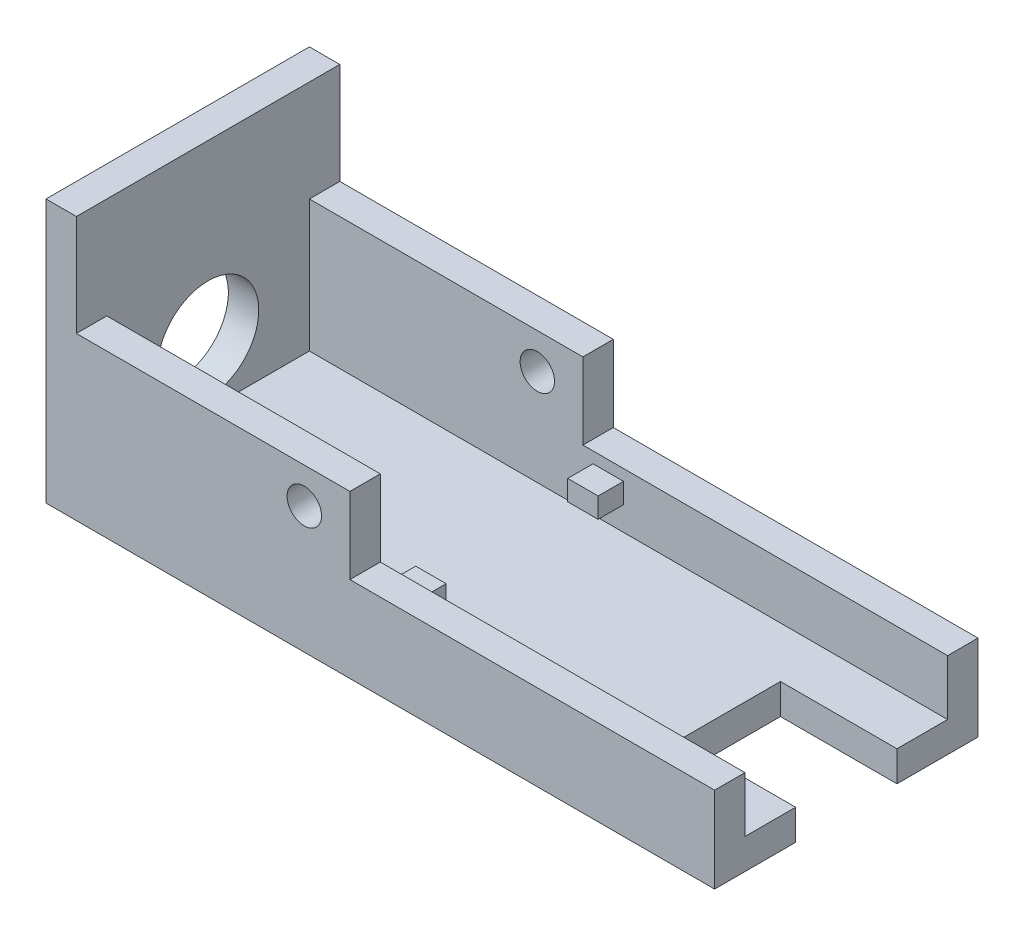
ISO-10303-21;
HEADER;
FILE_DESCRIPTION(('STEP AP214'),'2;1');
FILE_NAME('part.step','',(''),(''),'','','');
FILE_SCHEMA(('AUTOMOTIVE_DESIGN { 1 0 10303 214 1 1 1 1 }'));
ENDSEC;
DATA;
#1=APPLICATION_CONTEXT('core data for automotive mechanical design processes');
#2=APPLICATION_PROTOCOL_DEFINITION('international standard','automotive_design',2000,#1);
#3=PRODUCT_CONTEXT('',#1,'mechanical');
#4=PRODUCT('Part','Part','',(#3));
#5=PRODUCT_RELATED_PRODUCT_CATEGORY('part','',(#4));
#6=PRODUCT_DEFINITION_FORMATION('','',#4);
#7=PRODUCT_DEFINITION_CONTEXT('part definition',#1,'design');
#8=PRODUCT_DEFINITION('design','',#6,#7);
#9=PRODUCT_DEFINITION_SHAPE('','',#8);
#10=(LENGTH_UNIT() NAMED_UNIT(*) SI_UNIT(.MILLI.,.METRE.));
#11=(NAMED_UNIT(*) PLANE_ANGLE_UNIT() SI_UNIT($,.RADIAN.));
#12=(NAMED_UNIT(*) SI_UNIT($,.STERADIAN.) SOLID_ANGLE_UNIT());
#13=UNCERTAINTY_MEASURE_WITH_UNIT(LENGTH_MEASURE(1.E-05),#10,'distance_accuracy_value','');
#14=(GEOMETRIC_REPRESENTATION_CONTEXT(3) GLOBAL_UNCERTAINTY_ASSIGNED_CONTEXT((#13)) GLOBAL_UNIT_ASSIGNED_CONTEXT((#10,
#11,#12)) REPRESENTATION_CONTEXT('',''));
#15=CARTESIAN_POINT('',(0.,0.,0.));
#16=DIRECTION('',(0.,0.,1.));
#17=DIRECTION('',(1.,0.,0.));
#18=AXIS2_PLACEMENT_3D('',#15,#16,#17);
#19=CARTESIAN_POINT('',(-33.,3.,-13.));
#20=DIRECTION('',(0.,0.,-1.));
#21=DIRECTION('',(-1.,0.,0.));
#22=AXIS2_PLACEMENT_3D('',#19,#20,#21);
#23=PLANE('',#22);
#24=DIRECTION('',(1.,0.,0.));
#25=VECTOR('',#24,1.);
#26=CARTESIAN_POINT('',(-33.,0.,-13.));
#27=LINE('',#26,#25);
#28=CARTESIAN_POINT('',(-33.,0.,-13.));
#29=VERTEX_POINT('',#28);
#30=CARTESIAN_POINT('',(33.,0.,-13.));
#31=VERTEX_POINT('',#30);
#32=EDGE_CURVE('E396',#29,#31,#27,.T.);
#33=ORIENTED_EDGE('',*,*,#32,.F.);
#34=DIRECTION('',(0.,-1.,0.));
#35=VECTOR('',#34,1.);
#36=CARTESIAN_POINT('',(-33.,3.,-13.));
#37=LINE('',#36,#35);
#38=CARTESIAN_POINT('',(-33.,26.,-13.));
#39=VERTEX_POINT('',#38);
#40=EDGE_CURVE('E403',#39,#29,#37,.T.);
#41=ORIENTED_EDGE('',*,*,#40,.F.);
#42=DIRECTION('',(1.,0.,0.));
#43=VECTOR('',#42,1.);
#44=CARTESIAN_POINT('',(0.,26.,-13.));
#45=LINE('',#44,#43);
#46=CARTESIAN_POINT('',(-30.,26.,-13.));
#47=VERTEX_POINT('',#46);
#48=EDGE_CURVE('E328',#39,#47,#45,.T.);
#49=ORIENTED_EDGE('',*,*,#48,.T.);
#50=DIRECTION('',(0.,-1.,0.));
#51=VECTOR('',#50,1.);
#52=CARTESIAN_POINT('',(-30.,26.,-13.));
#53=LINE('',#52,#51);
#54=CARTESIAN_POINT('',(-30.,16.,-13.));
#55=VERTEX_POINT('',#54);
#56=EDGE_CURVE('E333',#47,#55,#53,.T.);
#57=ORIENTED_EDGE('',*,*,#56,.T.);
#58=DIRECTION('',(-1.,0.,0.));
#59=VECTOR('',#58,1.);
#60=CARTESIAN_POINT('',(0.,16.,-13.));
#61=LINE('',#60,#59);
#62=CARTESIAN_POINT('',(-3.,16.,-13.));
#63=VERTEX_POINT('',#62);
#64=EDGE_CURVE('E347',#63,#55,#61,.T.);
#65=ORIENTED_EDGE('',*,*,#64,.F.);
#66=DIRECTION('',(0.,-1.,0.));
#67=VECTOR('',#66,1.);
#68=CARTESIAN_POINT('',(-3.,16.,-13.));
#69=LINE('',#68,#67);
#70=CARTESIAN_POINT('',(-3.,8.46,-13.));
#71=VERTEX_POINT('',#70);
#72=EDGE_CURVE('E362',#63,#71,#69,.T.);
#73=ORIENTED_EDGE('',*,*,#72,.T.);
#74=DIRECTION('',(-1.,0.,0.));
#75=VECTOR('',#74,1.);
#76=CARTESIAN_POINT('',(0.,8.46,-13.));
#77=LINE('',#76,#75);
#78=CARTESIAN_POINT('',(33.,8.46,-13.));
#79=VERTEX_POINT('',#78);
#80=EDGE_CURVE('E309',#79,#71,#77,.T.);
#81=ORIENTED_EDGE('',*,*,#80,.F.);
#82=DIRECTION('',(0.,-1.,0.));
#83=VECTOR('',#82,1.);
#84=CARTESIAN_POINT('',(33.,3.,-13.));
#85=LINE('',#84,#83);
#86=EDGE_CURVE('E405',#79,#31,#85,.T.);
#87=ORIENTED_EDGE('',*,*,#86,.T.);
#88=EDGE_LOOP('',(#33,#41,#49,#57,#65,#73,#81,#87));
#89=FACE_BOUND('',#88,.T.);
#90=CARTESIAN_POINT('',(-7.5,12.5,-13.));
#91=DIRECTION('',(0.,0.,1.));
#92=DIRECTION('',(1.,0.,0.));
#93=AXIS2_PLACEMENT_3D('',#90,#91,#92);
#94=CIRCLE('',#93,1.7);
#95=CARTESIAN_POINT('',(-5.8,12.5,-13.));
#96=VERTEX_POINT('',#95);
#97=EDGE_CURVE('E424',#96,#96,#94,.T.);
#98=ORIENTED_EDGE('',*,*,#97,.T.);
#99=EDGE_LOOP('',(#98));
#100=FACE_BOUND('',#99,.T.);
#101=ADVANCED_FACE('F37',(#89,#100),#23,.T.);
#102=CARTESIAN_POINT('',(33.,3.,13.));
#103=DIRECTION('',(-1.,0.,0.));
#104=DIRECTION('',(0.,0.,1.));
#105=AXIS2_PLACEMENT_3D('',#102,#103,#104);
#106=PLANE('',#105);
#107=DIRECTION('',(0.,0.,-1.));
#108=VECTOR('',#107,1.);
#109=CARTESIAN_POINT('',(33.,3.,13.));
#110=LINE('',#109,#108);
#111=CARTESIAN_POINT('',(33.,3.,-5.));
#112=VERTEX_POINT('',#111);
#113=CARTESIAN_POINT('',(33.,3.,-10.));
#114=VERTEX_POINT('',#113);
#115=EDGE_CURVE('E389',#112,#114,#110,.T.);
#116=ORIENTED_EDGE('',*,*,#115,.F.);
#117=DIRECTION('',(0.,-1.,0.));
#118=VECTOR('',#117,1.);
#119=CARTESIAN_POINT('',(33.,26.,-5.));
#120=LINE('',#119,#118);
#121=CARTESIAN_POINT('',(33.,0.,-5.));
#122=VERTEX_POINT('',#121);
#123=EDGE_CURVE('E231',#112,#122,#120,.T.);
#124=ORIENTED_EDGE('',*,*,#123,.T.);
#125=DIRECTION('',(0.,0.,-1.));
#126=VECTOR('',#125,1.);
#127=CARTESIAN_POINT('',(33.,0.,13.));
#128=LINE('',#127,#126);
#129=EDGE_CURVE('E392',#122,#31,#128,.T.);
#130=ORIENTED_EDGE('',*,*,#129,.T.);
#131=ORIENTED_EDGE('',*,*,#86,.F.);
#132=DIRECTION('',(0.,0.,-1.));
#133=VECTOR('',#132,1.);
#134=CARTESIAN_POINT('',(33.,8.46,0.));
#135=LINE('',#134,#133);
#136=CARTESIAN_POINT('',(33.,8.46,-10.));
#137=VERTEX_POINT('',#136);
#138=EDGE_CURVE('E318',#137,#79,#135,.T.);
#139=ORIENTED_EDGE('',*,*,#138,.F.);
#140=DIRECTION('',(0.,-1.,0.));
#141=VECTOR('',#140,1.);
#142=CARTESIAN_POINT('',(33.,6.,-10.));
#143=LINE('',#142,#141);
#144=EDGE_CURVE('E374',#137,#114,#143,.T.);
#145=ORIENTED_EDGE('',*,*,#144,.T.);
#146=EDGE_LOOP('',(#116,#124,#130,#131,#139,#145));
#147=FACE_BOUND('',#146,.T.);
#148=ADVANCED_FACE('F464',(#147),#106,.F.);
#149=CARTESIAN_POINT('',(0.,6.,-10.));
#150=DIRECTION('',(0.,0.,1.));
#151=DIRECTION('',(1.,0.,0.));
#152=AXIS2_PLACEMENT_3D('',#149,#150,#151);
#153=PLANE('',#152);
#154=CARTESIAN_POINT('',(-7.5,12.5,-10.));
#155=DIRECTION('',(0.,0.,1.));
#156=DIRECTION('',(1.,0.,0.));
#157=AXIS2_PLACEMENT_3D('',#154,#155,#156);
#158=CIRCLE('',#157,1.7);
#159=CARTESIAN_POINT('',(-5.8,12.5,-10.));
#160=VERTEX_POINT('',#159);
#161=EDGE_CURVE('E418',#160,#160,#158,.T.);
#162=ORIENTED_EDGE('',*,*,#161,.F.);
#163=EDGE_LOOP('',(#162));
#164=FACE_BOUND('',#163,.T.);
#165=DIRECTION('',(-1.,0.,0.));
#166=VECTOR('',#165,1.);
#167=CARTESIAN_POINT('',(0.,3.,-10.));
#168=LINE('',#167,#166);
#169=CARTESIAN_POINT('',(-30.,3.,-10.));
#170=VERTEX_POINT('',#169);
#171=EDGE_CURVE('E367',#114,#170,#168,.T.);
#172=ORIENTED_EDGE('',*,*,#171,.F.);
#173=ORIENTED_EDGE('',*,*,#144,.F.);
#174=DIRECTION('',(1.,0.,0.));
#175=VECTOR('',#174,1.);
#176=CARTESIAN_POINT('',(0.,8.46,-10.));
#177=LINE('',#176,#175);
#178=CARTESIAN_POINT('',(-3.,8.46,-10.));
#179=VERTEX_POINT('',#178);
#180=EDGE_CURVE('E315',#179,#137,#177,.T.);
#181=ORIENTED_EDGE('',*,*,#180,.F.);
#182=DIRECTION('',(0.,-1.,0.));
#183=VECTOR('',#182,1.);
#184=CARTESIAN_POINT('',(-3.,16.,-10.));
#185=LINE('',#184,#183);
#186=CARTESIAN_POINT('',(-3.,16.,-10.));
#187=VERTEX_POINT('',#186);
#188=EDGE_CURVE('E365',#187,#179,#185,.T.);
#189=ORIENTED_EDGE('',*,*,#188,.F.);
#190=DIRECTION('',(1.,0.,0.));
#191=VECTOR('',#190,1.);
#192=CARTESIAN_POINT('',(0.,16.,-10.));
#193=LINE('',#192,#191);
#194=CARTESIAN_POINT('',(-30.,16.,-10.));
#195=VERTEX_POINT('',#194);
#196=EDGE_CURVE('E340',#195,#187,#193,.T.);
#197=ORIENTED_EDGE('',*,*,#196,.F.);
#198=DIRECTION('',(0.,-1.,0.));
#199=VECTOR('',#198,1.);
#200=CARTESIAN_POINT('',(-30.,6.,-10.));
#201=LINE('',#200,#199);
#202=EDGE_CURVE('E382',#195,#170,#201,.T.);
#203=ORIENTED_EDGE('',*,*,#202,.T.);
#204=EDGE_LOOP('',(#172,#173,#181,#189,#197,#203));
#205=FACE_BOUND('',#204,.T.);
#206=DIRECTION('',(-1.,0.,0.));
#207=VECTOR('',#206,1.);
#208=CARTESIAN_POINT('',(-2.,7.36,-10.));
#209=LINE('',#208,#207);
#210=CARTESIAN_POINT('',(1.,7.36,-10.));
#211=VERTEX_POINT('',#210);
#212=CARTESIAN_POINT('',(-2.,7.36,-10.));
#213=VERTEX_POINT('',#212);
#214=EDGE_CURVE('E282',#211,#213,#209,.T.);
#215=ORIENTED_EDGE('',*,*,#214,.F.);
#216=DIRECTION('',(0.,1.,0.));
#217=VECTOR('',#216,1.);
#218=CARTESIAN_POINT('',(1.,7.36,-10.));
#219=LINE('',#218,#217);
#220=CARTESIAN_POINT('',(1.,5.36,-10.));
#221=VERTEX_POINT('',#220);
#222=EDGE_CURVE('E268',#221,#211,#219,.T.);
#223=ORIENTED_EDGE('',*,*,#222,.F.);
#224=DIRECTION('',(1.,0.,0.));
#225=VECTOR('',#224,1.);
#226=CARTESIAN_POINT('',(-2.,5.36,-10.));
#227=LINE('',#226,#225);
#228=CARTESIAN_POINT('',(-2.,5.36,-10.));
#229=VERTEX_POINT('',#228);
#230=EDGE_CURVE('E273',#229,#221,#227,.T.);
#231=ORIENTED_EDGE('',*,*,#230,.F.);
#232=DIRECTION('',(0.,-1.,0.));
#233=VECTOR('',#232,1.);
#234=CARTESIAN_POINT('',(-2.,7.36,-10.));
#235=LINE('',#234,#233);
#236=EDGE_CURVE('E284',#213,#229,#235,.T.);
#237=ORIENTED_EDGE('',*,*,#236,.F.);
#238=EDGE_LOOP('',(#215,#223,#231,#237));
#239=FACE_BOUND('',#238,.T.);
#240=ADVANCED_FACE('F471',(#164,#205,#239),#153,.T.);
#241=CARTESIAN_POINT('',(0.,16.,0.));
#242=DIRECTION('',(0.,1.,0.));
#243=DIRECTION('',(0.,0.,1.));
#244=AXIS2_PLACEMENT_3D('',#241,#242,#243);
#245=PLANE('',#244);
#246=DIRECTION('',(0.,0.,-1.));
#247=VECTOR('',#246,1.);
#248=CARTESIAN_POINT('',(-30.,16.,0.));
#249=LINE('',#248,#247);
#250=CARTESIAN_POINT('',(-30.,16.,13.));
#251=VERTEX_POINT('',#250);
#252=CARTESIAN_POINT('',(-30.,16.,10.));
#253=VERTEX_POINT('',#252);
#254=EDGE_CURVE('E321',#251,#253,#249,.T.);
#255=ORIENTED_EDGE('',*,*,#254,.F.);
#256=DIRECTION('',(1.,0.,0.));
#257=VECTOR('',#256,1.);
#258=CARTESIAN_POINT('',(0.,16.,13.));
#259=LINE('',#258,#257);
#260=CARTESIAN_POINT('',(-3.,16.,13.));
#261=VERTEX_POINT('',#260);
#262=EDGE_CURVE('E349',#251,#261,#259,.T.);
#263=ORIENTED_EDGE('',*,*,#262,.T.);
#264=DIRECTION('',(0.,0.,1.));
#265=VECTOR('',#264,1.);
#266=CARTESIAN_POINT('',(-3.,16.,0.));
#267=LINE('',#266,#265);
#268=CARTESIAN_POINT('',(-3.,16.,10.));
#269=VERTEX_POINT('',#268);
#270=EDGE_CURVE('E351',#269,#261,#267,.T.);
#271=ORIENTED_EDGE('',*,*,#270,.F.);
#272=DIRECTION('',(-1.,0.,0.));
#273=VECTOR('',#272,1.);
#274=CARTESIAN_POINT('',(0.,16.,10.));
#275=LINE('',#274,#273);
#276=EDGE_CURVE('E354',#269,#253,#275,.T.);
#277=ORIENTED_EDGE('',*,*,#276,.T.);
#278=EDGE_LOOP('',(#255,#263,#271,#277));
#279=FACE_BOUND('',#278,.T.);
#280=ADVANCED_FACE('F521',(#279),#245,.T.);
#281=CARTESIAN_POINT('',(0.,3.,0.));
#282=DIRECTION('',(0.,1.,0.));
#283=DIRECTION('',(0.,0.,1.));
#284=AXIS2_PLACEMENT_3D('',#281,#282,#283);
#285=PLANE('',#284);
#286=DIRECTION('',(-1.,0.,0.));
#287=VECTOR('',#286,1.);
#288=CARTESIAN_POINT('',(0.,3.,-5.));
#289=LINE('',#288,#287);
#290=CARTESIAN_POINT('',(21.5,3.,-5.));
#291=VERTEX_POINT('',#290);
#292=EDGE_CURVE('E221',#112,#291,#289,.T.);
#293=ORIENTED_EDGE('',*,*,#292,.F.);
#294=ORIENTED_EDGE('',*,*,#115,.T.);
#295=ORIENTED_EDGE('',*,*,#171,.T.);
#296=DIRECTION('',(0.,0.,1.));
#297=VECTOR('',#296,1.);
#298=CARTESIAN_POINT('',(-30.,3.,0.));
#299=LINE('',#298,#297);
#300=CARTESIAN_POINT('',(-30.,3.,10.));
#301=VERTEX_POINT('',#300);
#302=EDGE_CURVE('E369',#170,#301,#299,.T.);
#303=ORIENTED_EDGE('',*,*,#302,.T.);
#304=DIRECTION('',(-1.,0.,0.));
#305=VECTOR('',#304,1.);
#306=CARTESIAN_POINT('',(0.,3.,10.));
#307=LINE('',#306,#305);
#308=CARTESIAN_POINT('',(33.,3.,10.));
#309=VERTEX_POINT('',#308);
#310=EDGE_CURVE('E371',#309,#301,#307,.T.);
#311=ORIENTED_EDGE('',*,*,#310,.F.);
#312=CARTESIAN_POINT('',(33.,3.,5.));
#313=VERTEX_POINT('',#312);
#314=EDGE_CURVE('E230',#309,#313,#110,.T.);
#315=ORIENTED_EDGE('',*,*,#314,.T.);
#316=DIRECTION('',(1.,0.,0.));
#317=VECTOR('',#316,1.);
#318=CARTESIAN_POINT('',(0.,3.,5.));
#319=LINE('',#318,#317);
#320=CARTESIAN_POINT('',(21.5,3.,5.));
#321=VERTEX_POINT('',#320);
#322=EDGE_CURVE('E222',#321,#313,#319,.T.);
#323=ORIENTED_EDGE('',*,*,#322,.F.);
#324=DIRECTION('',(0.,0.,1.));
#325=VECTOR('',#324,1.);
#326=CARTESIAN_POINT('',(21.5,3.,0.));
#327=LINE('',#326,#325);
#328=EDGE_CURVE('E211',#291,#321,#327,.T.);
#329=ORIENTED_EDGE('',*,*,#328,.F.);
#330=EDGE_LOOP('',(#293,#294,#295,#303,#311,#315,#323,#329));
#331=FACE_BOUND('',#330,.T.);
#332=ADVANCED_FACE('F228',(#331),#285,.T.);
#333=CARTESIAN_POINT('',(-33.,3.,13.));
#334=DIRECTION('',(0.,0.,-1.));
#335=DIRECTION('',(-1.,0.,0.));
#336=AXIS2_PLACEMENT_3D('',#333,#334,#335);
#337=PLANE('',#336);
#338=CARTESIAN_POINT('',(-7.5,12.5,13.));
#339=DIRECTION('',(0.,0.,1.));
#340=DIRECTION('',(1.,0.,0.));
#341=AXIS2_PLACEMENT_3D('',#338,#339,#340);
#342=CIRCLE('',#341,1.7);
#343=CARTESIAN_POINT('',(-5.8,12.5,13.));
#344=VERTEX_POINT('',#343);
#345=EDGE_CURVE('E427',#344,#344,#342,.T.);
#346=ORIENTED_EDGE('',*,*,#345,.F.);
#347=EDGE_LOOP('',(#346));
#348=FACE_BOUND('',#347,.T.);
#349=DIRECTION('',(1.,0.,0.));
#350=VECTOR('',#349,1.);
#351=CARTESIAN_POINT('',(-33.,0.,13.));
#352=LINE('',#351,#350);
#353=CARTESIAN_POINT('',(-33.,0.,13.));
#354=VERTEX_POINT('',#353);
#355=CARTESIAN_POINT('',(33.,0.,13.));
#356=VERTEX_POINT('',#355);
#357=EDGE_CURVE('E378',#354,#356,#352,.T.);
#358=ORIENTED_EDGE('',*,*,#357,.T.);
#359=DIRECTION('',(0.,-1.,0.));
#360=VECTOR('',#359,1.);
#361=CARTESIAN_POINT('',(33.,3.,13.));
#362=LINE('',#361,#360);
#363=CARTESIAN_POINT('',(33.,8.46,13.));
#364=VERTEX_POINT('',#363);
#365=EDGE_CURVE('E408',#364,#356,#362,.T.);
#366=ORIENTED_EDGE('',*,*,#365,.F.);
#367=DIRECTION('',(1.,0.,0.));
#368=VECTOR('',#367,1.);
#369=CARTESIAN_POINT('',(0.,8.46,13.));
#370=LINE('',#369,#368);
#371=CARTESIAN_POINT('',(-3.,8.46,13.));
#372=VERTEX_POINT('',#371);
#373=EDGE_CURVE('E303',#372,#364,#370,.T.);
#374=ORIENTED_EDGE('',*,*,#373,.F.);
#375=DIRECTION('',(0.,-1.,0.));
#376=VECTOR('',#375,1.);
#377=CARTESIAN_POINT('',(-3.,16.,13.));
#378=LINE('',#377,#376);
#379=EDGE_CURVE('E360',#261,#372,#378,.T.);
#380=ORIENTED_EDGE('',*,*,#379,.F.);
#381=ORIENTED_EDGE('',*,*,#262,.F.);
#382=DIRECTION('',(0.,-1.,0.));
#383=VECTOR('',#382,1.);
#384=CARTESIAN_POINT('',(-30.,26.,13.));
#385=LINE('',#384,#383);
#386=CARTESIAN_POINT('',(-30.,26.,13.));
#387=VERTEX_POINT('',#386);
#388=EDGE_CURVE('E337',#387,#251,#385,.T.);
#389=ORIENTED_EDGE('',*,*,#388,.F.);
#390=DIRECTION('',(-1.,0.,0.));
#391=VECTOR('',#390,1.);
#392=CARTESIAN_POINT('',(0.,26.,13.));
#393=LINE('',#392,#391);
#394=CARTESIAN_POINT('',(-33.,26.,13.));
#395=VERTEX_POINT('',#394);
#396=EDGE_CURVE('E322',#387,#395,#393,.T.);
#397=ORIENTED_EDGE('',*,*,#396,.T.);
#398=DIRECTION('',(0.,-1.,0.));
#399=VECTOR('',#398,1.);
#400=CARTESIAN_POINT('',(-33.,3.,13.));
#401=LINE('',#400,#399);
#402=EDGE_CURVE('E388',#395,#354,#401,.T.);
#403=ORIENTED_EDGE('',*,*,#402,.T.);
#404=EDGE_LOOP('',(#358,#366,#374,#380,#381,#389,#397,#403));
#405=FACE_BOUND('',#404,.T.);
#406=ADVANCED_FACE('F39',(#348,#405),#337,.F.);
#407=CARTESIAN_POINT('',(33.,0.,5.));
#408=VERTEX_POINT('',#407);
#409=EDGE_CURVE('E393',#356,#408,#128,.T.);
#410=ORIENTED_EDGE('',*,*,#409,.T.);
#411=DIRECTION('',(0.,-1.,0.));
#412=VECTOR('',#411,1.);
#413=CARTESIAN_POINT('',(33.,26.,5.));
#414=LINE('',#413,#412);
#415=EDGE_CURVE('E52',#313,#408,#414,.T.);
#416=ORIENTED_EDGE('',*,*,#415,.F.);
#417=ORIENTED_EDGE('',*,*,#314,.F.);
#418=DIRECTION('',(0.,-1.,0.));
#419=VECTOR('',#418,1.);
#420=CARTESIAN_POINT('',(33.,6.,10.));
#421=LINE('',#420,#419);
#422=CARTESIAN_POINT('',(33.,8.46,10.));
#423=VERTEX_POINT('',#422);
#424=EDGE_CURVE('E375',#423,#309,#421,.T.);
#425=ORIENTED_EDGE('',*,*,#424,.F.);
#426=DIRECTION('',(0.,0.,-1.));
#427=VECTOR('',#426,1.);
#428=CARTESIAN_POINT('',(33.,8.46,0.));
#429=LINE('',#428,#427);
#430=EDGE_CURVE('E306',#364,#423,#429,.T.);
#431=ORIENTED_EDGE('',*,*,#430,.F.);
#432=ORIENTED_EDGE('',*,*,#365,.T.);
#433=EDGE_LOOP('',(#410,#416,#417,#425,#431,#432));
#434=FACE_BOUND('',#433,.T.);
#435=ADVANCED_FACE('F442',(#434),#106,.F.);
#436=CARTESIAN_POINT('',(-33.,3.,13.));
#437=DIRECTION('',(-1.,0.,0.));
#438=DIRECTION('',(0.,0.,1.));
#439=AXIS2_PLACEMENT_3D('',#436,#437,#438);
#440=PLANE('',#439);
#441=CARTESIAN_POINT('',(-33.,9.,0.));
#442=DIRECTION('',(-1.,0.,0.));
#443=DIRECTION('',(0.,0.,1.));
#444=AXIS2_PLACEMENT_3D('',#441,#442,#443);
#445=CIRCLE('',#444,5.);
#446=CARTESIAN_POINT('',(-33.,9.,5.));
#447=VERTEX_POINT('',#446);
#448=EDGE_CURVE('E430',#447,#447,#445,.T.);
#449=ORIENTED_EDGE('',*,*,#448,.F.);
#450=EDGE_LOOP('',(#449));
#451=FACE_BOUND('',#450,.T.);
#452=DIRECTION('',(0.,0.,-1.));
#453=VECTOR('',#452,1.);
#454=CARTESIAN_POINT('',(-33.,0.,13.));
#455=LINE('',#454,#453);
#456=EDGE_CURVE('E399',#354,#29,#455,.T.);
#457=ORIENTED_EDGE('',*,*,#456,.F.);
#458=ORIENTED_EDGE('',*,*,#402,.F.);
#459=DIRECTION('',(0.,0.,-1.));
#460=VECTOR('',#459,1.);
#461=CARTESIAN_POINT('',(-33.,26.,0.));
#462=LINE('',#461,#460);
#463=EDGE_CURVE('E325',#395,#39,#462,.T.);
#464=ORIENTED_EDGE('',*,*,#463,.T.);
#465=ORIENTED_EDGE('',*,*,#40,.T.);
#466=EDGE_LOOP('',(#457,#458,#464,#465));
#467=FACE_BOUND('',#466,.T.);
#468=ADVANCED_FACE('F439',(#451,#467),#440,.T.);
#469=CARTESIAN_POINT('',(0.,0.,0.));
#470=DIRECTION('',(0.,1.,0.));
#471=DIRECTION('',(0.,0.,1.));
#472=AXIS2_PLACEMENT_3D('',#469,#470,#471);
#473=PLANE('',#472);
#474=ORIENTED_EDGE('',*,*,#129,.F.);
#475=DIRECTION('',(-1.,0.,0.));
#476=VECTOR('',#475,1.);
#477=CARTESIAN_POINT('',(0.,0.,-5.));
#478=LINE('',#477,#476);
#479=CARTESIAN_POINT('',(21.5,0.,-5.));
#480=VERTEX_POINT('',#479);
#481=EDGE_CURVE('E11',#122,#480,#478,.T.);
#482=ORIENTED_EDGE('',*,*,#481,.T.);
#483=DIRECTION('',(0.,0.,1.));
#484=VECTOR('',#483,1.);
#485=CARTESIAN_POINT('',(21.5,0.,0.));
#486=LINE('',#485,#484);
#487=CARTESIAN_POINT('',(21.5,0.,5.));
#488=VERTEX_POINT('',#487);
#489=EDGE_CURVE('E45',#480,#488,#486,.T.);
#490=ORIENTED_EDGE('',*,*,#489,.T.);
#491=DIRECTION('',(1.,0.,0.));
#492=VECTOR('',#491,1.);
#493=CARTESIAN_POINT('',(0.,0.,5.));
#494=LINE('',#493,#492);
#495=EDGE_CURVE('E225',#488,#408,#494,.T.);
#496=ORIENTED_EDGE('',*,*,#495,.T.);
#497=ORIENTED_EDGE('',*,*,#409,.F.);
#498=ORIENTED_EDGE('',*,*,#357,.F.);
#499=ORIENTED_EDGE('',*,*,#456,.T.);
#500=ORIENTED_EDGE('',*,*,#32,.T.);
#501=EDGE_LOOP('',(#474,#482,#490,#496,#497,#498,#499,#500));
#502=FACE_BOUND('',#501,.T.);
#503=ADVANCED_FACE('F413',(#502),#473,.F.);
#504=CARTESIAN_POINT('',(0.,6.,10.));
#505=DIRECTION('',(0.,0.,1.));
#506=DIRECTION('',(1.,0.,0.));
#507=AXIS2_PLACEMENT_3D('',#504,#505,#506);
#508=PLANE('',#507);
#509=CARTESIAN_POINT('',(-7.5,12.5,10.));
#510=DIRECTION('',(0.,0.,1.));
#511=DIRECTION('',(1.,0.,0.));
#512=AXIS2_PLACEMENT_3D('',#509,#510,#511);
#513=CIRCLE('',#512,1.7);
#514=CARTESIAN_POINT('',(-5.8,12.5,10.));
#515=VERTEX_POINT('',#514);
#516=EDGE_CURVE('E421',#515,#515,#513,.T.);
#517=ORIENTED_EDGE('',*,*,#516,.T.);
#518=EDGE_LOOP('',(#517));
#519=FACE_BOUND('',#518,.T.);
#520=DIRECTION('',(1.,0.,0.));
#521=VECTOR('',#520,1.);
#522=CARTESIAN_POINT('',(-2.,5.36,10.));
#523=LINE('',#522,#521);
#524=CARTESIAN_POINT('',(-2.,5.36,10.));
#525=VERTEX_POINT('',#524);
#526=CARTESIAN_POINT('',(1.,5.36,10.));
#527=VERTEX_POINT('',#526);
#528=EDGE_CURVE('E255',#525,#527,#523,.T.);
#529=ORIENTED_EDGE('',*,*,#528,.T.);
#530=DIRECTION('',(0.,1.,0.));
#531=VECTOR('',#530,1.);
#532=CARTESIAN_POINT('',(1.,7.36,10.));
#533=LINE('',#532,#531);
#534=CARTESIAN_POINT('',(1.,7.36,10.));
#535=VERTEX_POINT('',#534);
#536=EDGE_CURVE('E238',#527,#535,#533,.T.);
#537=ORIENTED_EDGE('',*,*,#536,.T.);
#538=DIRECTION('',(-1.,0.,0.));
#539=VECTOR('',#538,1.);
#540=CARTESIAN_POINT('',(-2.,7.36,10.));
#541=LINE('',#540,#539);
#542=CARTESIAN_POINT('',(-2.,7.36,10.));
#543=VERTEX_POINT('',#542);
#544=EDGE_CURVE('E243',#535,#543,#541,.T.);
#545=ORIENTED_EDGE('',*,*,#544,.T.);
#546=DIRECTION('',(0.,-1.,0.));
#547=VECTOR('',#546,1.);
#548=CARTESIAN_POINT('',(-2.,7.36,10.));
#549=LINE('',#548,#547);
#550=EDGE_CURVE('E60',#543,#525,#549,.T.);
#551=ORIENTED_EDGE('',*,*,#550,.T.);
#552=EDGE_LOOP('',(#529,#537,#545,#551));
#553=FACE_BOUND('',#552,.T.);
#554=ORIENTED_EDGE('',*,*,#310,.T.);
#555=DIRECTION('',(0.,-1.,0.));
#556=VECTOR('',#555,1.);
#557=CARTESIAN_POINT('',(-30.,6.,10.));
#558=LINE('',#557,#556);
#559=EDGE_CURVE('E379',#253,#301,#558,.T.);
#560=ORIENTED_EDGE('',*,*,#559,.F.);
#561=ORIENTED_EDGE('',*,*,#276,.F.);
#562=DIRECTION('',(0.,-1.,0.));
#563=VECTOR('',#562,1.);
#564=CARTESIAN_POINT('',(-3.,16.,10.));
#565=LINE('',#564,#563);
#566=CARTESIAN_POINT('',(-3.,8.46,10.));
#567=VERTEX_POINT('',#566);
#568=EDGE_CURVE('E357',#269,#567,#565,.T.);
#569=ORIENTED_EDGE('',*,*,#568,.T.);
#570=DIRECTION('',(-1.,0.,0.));
#571=VECTOR('',#570,1.);
#572=CARTESIAN_POINT('',(0.,8.46,10.));
#573=LINE('',#572,#571);
#574=EDGE_CURVE('E297',#423,#567,#573,.T.);
#575=ORIENTED_EDGE('',*,*,#574,.F.);
#576=ORIENTED_EDGE('',*,*,#424,.T.);
#577=EDGE_LOOP('',(#554,#560,#561,#569,#575,#576));
#578=FACE_BOUND('',#577,.T.);
#579=ADVANCED_FACE('F481',(#519,#553,#578),#508,.F.);
#580=CARTESIAN_POINT('',(-30.,6.,0.));
#581=DIRECTION('',(1.,0.,0.));
#582=DIRECTION('',(0.,0.,-1.));
#583=AXIS2_PLACEMENT_3D('',#580,#581,#582);
#584=PLANE('',#583);
#585=CARTESIAN_POINT('',(-30.,9.,0.));
#586=DIRECTION('',(1.,0.,0.));
#587=DIRECTION('',(0.,0.,-1.));
#588=AXIS2_PLACEMENT_3D('',#585,#586,#587);
#589=CIRCLE('',#588,5.);
#590=CARTESIAN_POINT('',(-30.,9.,-5.));
#591=VERTEX_POINT('',#590);
#592=EDGE_CURVE('E431',#591,#591,#589,.F.);
#593=ORIENTED_EDGE('',*,*,#592,.T.);
#594=EDGE_LOOP('',(#593));
#595=FACE_BOUND('',#594,.T.);
#596=ORIENTED_EDGE('',*,*,#302,.F.);
#597=ORIENTED_EDGE('',*,*,#202,.F.);
#598=EDGE_CURVE('E336',#195,#55,#249,.T.);
#599=ORIENTED_EDGE('',*,*,#598,.T.);
#600=ORIENTED_EDGE('',*,*,#56,.F.);
#601=DIRECTION('',(0.,0.,-1.));
#602=VECTOR('',#601,1.);
#603=CARTESIAN_POINT('',(-30.,26.,0.));
#604=LINE('',#603,#602);
#605=EDGE_CURVE('E331',#387,#47,#604,.T.);
#606=ORIENTED_EDGE('',*,*,#605,.F.);
#607=ORIENTED_EDGE('',*,*,#388,.T.);
#608=ORIENTED_EDGE('',*,*,#254,.T.);
#609=ORIENTED_EDGE('',*,*,#559,.T.);
#610=EDGE_LOOP('',(#596,#597,#599,#600,#606,#607,#608,#609));
#611=FACE_BOUND('',#610,.T.);
#612=ADVANCED_FACE('F478',(#595,#611),#584,.T.);
#613=CARTESIAN_POINT('',(-3.,16.,0.));
#614=DIRECTION('',(1.,0.,0.));
#615=DIRECTION('',(0.,0.,-1.));
#616=AXIS2_PLACEMENT_3D('',#613,#614,#615);
#617=PLANE('',#616);
#618=DIRECTION('',(0.,0.,1.));
#619=VECTOR('',#618,1.);
#620=CARTESIAN_POINT('',(-3.,8.46,0.));
#621=LINE('',#620,#619);
#622=EDGE_CURVE('E312',#71,#179,#621,.T.);
#623=ORIENTED_EDGE('',*,*,#622,.F.);
#624=ORIENTED_EDGE('',*,*,#72,.F.);
#625=DIRECTION('',(0.,0.,1.));
#626=VECTOR('',#625,1.);
#627=CARTESIAN_POINT('',(-3.,16.,0.));
#628=LINE('',#627,#626);
#629=EDGE_CURVE('E344',#63,#187,#628,.T.);
#630=ORIENTED_EDGE('',*,*,#629,.T.);
#631=ORIENTED_EDGE('',*,*,#188,.T.);
#632=EDGE_LOOP('',(#623,#624,#630,#631));
#633=FACE_BOUND('',#632,.T.);
#634=ADVANCED_FACE('F496',(#633),#617,.T.);
#635=CARTESIAN_POINT('',(-3.,16.,0.));
#636=DIRECTION('',(1.,0.,0.));
#637=DIRECTION('',(0.,0.,-1.));
#638=AXIS2_PLACEMENT_3D('',#635,#636,#637);
#639=PLANE('',#638);
#640=DIRECTION('',(0.,0.,1.));
#641=VECTOR('',#640,1.);
#642=CARTESIAN_POINT('',(-3.,8.46,0.));
#643=LINE('',#642,#641);
#644=EDGE_CURVE('E300',#567,#372,#643,.T.);
#645=ORIENTED_EDGE('',*,*,#644,.F.);
#646=ORIENTED_EDGE('',*,*,#568,.F.);
#647=ORIENTED_EDGE('',*,*,#270,.T.);
#648=ORIENTED_EDGE('',*,*,#379,.T.);
#649=EDGE_LOOP('',(#645,#646,#647,#648));
#650=FACE_BOUND('',#649,.T.);
#651=ADVANCED_FACE('F489',(#650),#639,.T.);
#652=ORIENTED_EDGE('',*,*,#598,.F.);
#653=ORIENTED_EDGE('',*,*,#196,.T.);
#654=ORIENTED_EDGE('',*,*,#629,.F.);
#655=ORIENTED_EDGE('',*,*,#64,.T.);
#656=EDGE_LOOP('',(#652,#653,#654,#655));
#657=FACE_BOUND('',#656,.T.);
#658=ADVANCED_FACE('F493',(#657),#245,.T.);
#659=CARTESIAN_POINT('',(0.,26.,0.));
#660=DIRECTION('',(0.,-1.,0.));
#661=DIRECTION('',(0.,0.,-1.));
#662=AXIS2_PLACEMENT_3D('',#659,#660,#661);
#663=PLANE('',#662);
#664=ORIENTED_EDGE('',*,*,#396,.F.);
#665=ORIENTED_EDGE('',*,*,#605,.T.);
#666=ORIENTED_EDGE('',*,*,#48,.F.);
#667=ORIENTED_EDGE('',*,*,#463,.F.);
#668=EDGE_LOOP('',(#664,#665,#666,#667));
#669=FACE_BOUND('',#668,.T.);
#670=ADVANCED_FACE('F454',(#669),#663,.F.);
#671=CARTESIAN_POINT('',(0.,8.46,0.));
#672=DIRECTION('',(0.,1.,0.));
#673=DIRECTION('',(0.,0.,1.));
#674=AXIS2_PLACEMENT_3D('',#671,#672,#673);
#675=PLANE('',#674);
#676=ORIENTED_EDGE('',*,*,#80,.T.);
#677=ORIENTED_EDGE('',*,*,#622,.T.);
#678=ORIENTED_EDGE('',*,*,#180,.T.);
#679=ORIENTED_EDGE('',*,*,#138,.T.);
#680=EDGE_LOOP('',(#676,#677,#678,#679));
#681=FACE_BOUND('',#680,.T.);
#682=ADVANCED_FACE('F466',(#681),#675,.T.);
#683=CARTESIAN_POINT('',(0.,8.46,0.));
#684=DIRECTION('',(0.,1.,0.));
#685=DIRECTION('',(0.,0.,1.));
#686=AXIS2_PLACEMENT_3D('',#683,#684,#685);
#687=PLANE('',#686);
#688=ORIENTED_EDGE('',*,*,#574,.T.);
#689=ORIENTED_EDGE('',*,*,#644,.T.);
#690=ORIENTED_EDGE('',*,*,#373,.T.);
#691=ORIENTED_EDGE('',*,*,#430,.T.);
#692=EDGE_LOOP('',(#688,#689,#690,#691));
#693=FACE_BOUND('',#692,.T.);
#694=ADVANCED_FACE('F486',(#693),#687,.T.);
#695=CARTESIAN_POINT('',(1.,7.36,-7.5));
#696=DIRECTION('',(-1.,0.,0.));
#697=DIRECTION('',(0.,0.,1.));
#698=AXIS2_PLACEMENT_3D('',#695,#696,#697);
#699=PLANE('',#698);
#700=ORIENTED_EDGE('',*,*,#222,.T.);
#701=DIRECTION('',(0.,0.,-1.));
#702=VECTOR('',#701,1.);
#703=CARTESIAN_POINT('',(1.,7.36,-7.5));
#704=LINE('',#703,#702);
#705=CARTESIAN_POINT('',(1.,7.36,-7.5));
#706=VERTEX_POINT('',#705);
#707=EDGE_CURVE('E295',#706,#211,#704,.T.);
#708=ORIENTED_EDGE('',*,*,#707,.F.);
#709=DIRECTION('',(0.,1.,0.));
#710=VECTOR('',#709,1.);
#711=CARTESIAN_POINT('',(1.,7.36,-7.5));
#712=LINE('',#711,#710);
#713=CARTESIAN_POINT('',(1.,5.36,-7.5));
#714=VERTEX_POINT('',#713);
#715=EDGE_CURVE('E269',#714,#706,#712,.T.);
#716=ORIENTED_EDGE('',*,*,#715,.F.);
#717=DIRECTION('',(0.,0.,-1.));
#718=VECTOR('',#717,1.);
#719=CARTESIAN_POINT('',(1.,5.36,-7.5));
#720=LINE('',#719,#718);
#721=EDGE_CURVE('E279',#714,#221,#720,.T.);
#722=ORIENTED_EDGE('',*,*,#721,.T.);
#723=EDGE_LOOP('',(#700,#708,#716,#722));
#724=FACE_BOUND('',#723,.T.);
#725=ADVANCED_FACE('F582',(#724),#699,.F.);
#726=CARTESIAN_POINT('',(-2.,7.36,-7.5));
#727=DIRECTION('',(0.,-1.,0.));
#728=DIRECTION('',(0.,0.,-1.));
#729=AXIS2_PLACEMENT_3D('',#726,#727,#728);
#730=PLANE('',#729);
#731=ORIENTED_EDGE('',*,*,#214,.T.);
#732=DIRECTION('',(0.,0.,-1.));
#733=VECTOR('',#732,1.);
#734=CARTESIAN_POINT('',(-2.,7.36,-7.5));
#735=LINE('',#734,#733);
#736=CARTESIAN_POINT('',(-2.,7.36,-7.5));
#737=VERTEX_POINT('',#736);
#738=EDGE_CURVE('E292',#737,#213,#735,.T.);
#739=ORIENTED_EDGE('',*,*,#738,.F.);
#740=DIRECTION('',(-1.,0.,0.));
#741=VECTOR('',#740,1.);
#742=CARTESIAN_POINT('',(-2.,7.36,-7.5));
#743=LINE('',#742,#741);
#744=EDGE_CURVE('E272',#706,#737,#743,.T.);
#745=ORIENTED_EDGE('',*,*,#744,.F.);
#746=ORIENTED_EDGE('',*,*,#707,.T.);
#747=EDGE_LOOP('',(#731,#739,#745,#746));
#748=FACE_BOUND('',#747,.T.);
#749=ADVANCED_FACE('F578',(#748),#730,.F.);
#750=CARTESIAN_POINT('',(-2.,7.36,-7.5));
#751=DIRECTION('',(1.,0.,0.));
#752=DIRECTION('',(0.,0.,-1.));
#753=AXIS2_PLACEMENT_3D('',#750,#751,#752);
#754=PLANE('',#753);
#755=ORIENTED_EDGE('',*,*,#236,.T.);
#756=DIRECTION('',(0.,0.,-1.));
#757=VECTOR('',#756,1.);
#758=CARTESIAN_POINT('',(-2.,5.36,-7.5));
#759=LINE('',#758,#757);
#760=CARTESIAN_POINT('',(-2.,5.36,-7.5));
#761=VERTEX_POINT('',#760);
#762=EDGE_CURVE('E290',#761,#229,#759,.T.);
#763=ORIENTED_EDGE('',*,*,#762,.F.);
#764=DIRECTION('',(0.,-1.,0.));
#765=VECTOR('',#764,1.);
#766=CARTESIAN_POINT('',(-2.,7.36,-7.5));
#767=LINE('',#766,#765);
#768=EDGE_CURVE('E275',#737,#761,#767,.T.);
#769=ORIENTED_EDGE('',*,*,#768,.F.);
#770=ORIENTED_EDGE('',*,*,#738,.T.);
#771=EDGE_LOOP('',(#755,#763,#769,#770));
#772=FACE_BOUND('',#771,.T.);
#773=ADVANCED_FACE('F574',(#772),#754,.F.);
#774=CARTESIAN_POINT('',(-2.,5.36,-7.5));
#775=DIRECTION('',(0.,1.,0.));
#776=DIRECTION('',(0.,0.,1.));
#777=AXIS2_PLACEMENT_3D('',#774,#775,#776);
#778=PLANE('',#777);
#779=ORIENTED_EDGE('',*,*,#230,.T.);
#780=ORIENTED_EDGE('',*,*,#721,.F.);
#781=DIRECTION('',(1.,0.,0.));
#782=VECTOR('',#781,1.);
#783=CARTESIAN_POINT('',(-2.,5.36,-7.5));
#784=LINE('',#783,#782);
#785=EDGE_CURVE('E277',#761,#714,#784,.T.);
#786=ORIENTED_EDGE('',*,*,#785,.F.);
#787=ORIENTED_EDGE('',*,*,#762,.T.);
#788=EDGE_LOOP('',(#779,#780,#786,#787));
#789=FACE_BOUND('',#788,.T.);
#790=ADVANCED_FACE('F570',(#789),#778,.F.);
#791=CARTESIAN_POINT('',(0.,0.,-7.5));
#792=DIRECTION('',(0.,0.,1.));
#793=DIRECTION('',(1.,0.,0.));
#794=AXIS2_PLACEMENT_3D('',#791,#792,#793);
#795=PLANE('',#794);
#796=ORIENTED_EDGE('',*,*,#715,.T.);
#797=ORIENTED_EDGE('',*,*,#744,.T.);
#798=ORIENTED_EDGE('',*,*,#768,.T.);
#799=ORIENTED_EDGE('',*,*,#785,.T.);
#800=EDGE_LOOP('',(#796,#797,#798,#799));
#801=FACE_BOUND('',#800,.T.);
#802=ADVANCED_FACE('F567',(#801),#795,.T.);
#803=CARTESIAN_POINT('',(1.,7.36,7.5));
#804=DIRECTION('',(1.,0.,0.));
#805=DIRECTION('',(0.,0.,-1.));
#806=AXIS2_PLACEMENT_3D('',#803,#804,#805);
#807=PLANE('',#806);
#808=ORIENTED_EDGE('',*,*,#536,.F.);
#809=DIRECTION('',(0.,0.,1.));
#810=VECTOR('',#809,1.);
#811=CARTESIAN_POINT('',(1.,5.36,7.5));
#812=LINE('',#811,#810);
#813=CARTESIAN_POINT('',(1.,5.36,7.5));
#814=VERTEX_POINT('',#813);
#815=EDGE_CURVE('E266',#814,#527,#812,.T.);
#816=ORIENTED_EDGE('',*,*,#815,.F.);
#817=DIRECTION('',(0.,1.,0.));
#818=VECTOR('',#817,1.);
#819=CARTESIAN_POINT('',(1.,7.36,7.5));
#820=LINE('',#819,#818);
#821=CARTESIAN_POINT('',(1.,7.36,7.5));
#822=VERTEX_POINT('',#821);
#823=EDGE_CURVE('E239',#814,#822,#820,.T.);
#824=ORIENTED_EDGE('',*,*,#823,.T.);
#825=DIRECTION('',(0.,0.,1.));
#826=VECTOR('',#825,1.);
#827=CARTESIAN_POINT('',(1.,7.36,7.5));
#828=LINE('',#827,#826);
#829=EDGE_CURVE('E252',#822,#535,#828,.T.);
#830=ORIENTED_EDGE('',*,*,#829,.T.);
#831=EDGE_LOOP('',(#808,#816,#824,#830));
#832=FACE_BOUND('',#831,.T.);
#833=ADVANCED_FACE('F541',(#832),#807,.T.);
#834=CARTESIAN_POINT('',(-2.,5.36,7.5));
#835=DIRECTION('',(0.,-1.,0.));
#836=DIRECTION('',(0.,0.,-1.));
#837=AXIS2_PLACEMENT_3D('',#834,#835,#836);
#838=PLANE('',#837);
#839=ORIENTED_EDGE('',*,*,#528,.F.);
#840=DIRECTION('',(0.,0.,1.));
#841=VECTOR('',#840,1.);
#842=CARTESIAN_POINT('',(-2.,5.36,7.5));
#843=LINE('',#842,#841);
#844=CARTESIAN_POINT('',(-2.,5.36,7.5));
#845=VERTEX_POINT('',#844);
#846=EDGE_CURVE('E264',#845,#525,#843,.T.);
#847=ORIENTED_EDGE('',*,*,#846,.F.);
#848=DIRECTION('',(1.,0.,0.));
#849=VECTOR('',#848,1.);
#850=CARTESIAN_POINT('',(-2.,5.36,7.5));
#851=LINE('',#850,#849);
#852=EDGE_CURVE('E242',#845,#814,#851,.T.);
#853=ORIENTED_EDGE('',*,*,#852,.T.);
#854=ORIENTED_EDGE('',*,*,#815,.T.);
#855=EDGE_LOOP('',(#839,#847,#853,#854));
#856=FACE_BOUND('',#855,.T.);
#857=ADVANCED_FACE('F537',(#856),#838,.T.);
#858=CARTESIAN_POINT('',(-2.,7.36,7.5));
#859=DIRECTION('',(-1.,0.,0.));
#860=DIRECTION('',(0.,0.,1.));
#861=AXIS2_PLACEMENT_3D('',#858,#859,#860);
#862=PLANE('',#861);
#863=ORIENTED_EDGE('',*,*,#550,.F.);
#864=DIRECTION('',(0.,0.,1.));
#865=VECTOR('',#864,1.);
#866=CARTESIAN_POINT('',(-2.,7.36,7.5));
#867=LINE('',#866,#865);
#868=CARTESIAN_POINT('',(-2.,7.36,7.5));
#869=VERTEX_POINT('',#868);
#870=EDGE_CURVE('E262',#869,#543,#867,.T.);
#871=ORIENTED_EDGE('',*,*,#870,.F.);
#872=DIRECTION('',(0.,-1.,0.));
#873=VECTOR('',#872,1.);
#874=CARTESIAN_POINT('',(-2.,7.36,7.5));
#875=LINE('',#874,#873);
#876=EDGE_CURVE('E246',#869,#845,#875,.T.);
#877=ORIENTED_EDGE('',*,*,#876,.T.);
#878=ORIENTED_EDGE('',*,*,#846,.T.);
#879=EDGE_LOOP('',(#863,#871,#877,#878));
#880=FACE_BOUND('',#879,.T.);
#881=ADVANCED_FACE('F547',(#880),#862,.T.);
#882=CARTESIAN_POINT('',(-2.,7.36,7.5));
#883=DIRECTION('',(0.,1.,0.));
#884=DIRECTION('',(0.,0.,1.));
#885=AXIS2_PLACEMENT_3D('',#882,#883,#884);
#886=PLANE('',#885);
#887=ORIENTED_EDGE('',*,*,#544,.F.);
#888=ORIENTED_EDGE('',*,*,#829,.F.);
#889=DIRECTION('',(-1.,0.,0.));
#890=VECTOR('',#889,1.);
#891=CARTESIAN_POINT('',(-2.,7.36,7.5));
#892=LINE('',#891,#890);
#893=EDGE_CURVE('E249',#822,#869,#892,.T.);
#894=ORIENTED_EDGE('',*,*,#893,.T.);
#895=ORIENTED_EDGE('',*,*,#870,.T.);
#896=EDGE_LOOP('',(#887,#888,#894,#895));
#897=FACE_BOUND('',#896,.T.);
#898=ADVANCED_FACE('F545',(#897),#886,.T.);
#899=CARTESIAN_POINT('',(0.,0.,7.5));
#900=DIRECTION('',(0.,0.,-1.));
#901=DIRECTION('',(1.,0.,0.));
#902=AXIS2_PLACEMENT_3D('',#899,#900,#901);
#903=PLANE('',#902);
#904=ORIENTED_EDGE('',*,*,#823,.F.);
#905=ORIENTED_EDGE('',*,*,#852,.F.);
#906=ORIENTED_EDGE('',*,*,#876,.F.);
#907=ORIENTED_EDGE('',*,*,#893,.F.);
#908=EDGE_LOOP('',(#904,#905,#906,#907));
#909=FACE_BOUND('',#908,.T.);
#910=ADVANCED_FACE('F549',(#909),#903,.T.);
#911=CARTESIAN_POINT('',(21.5,26.,-5.));
#912=DIRECTION('',(0.,0.,-1.));
#913=DIRECTION('',(-1.,0.,0.));
#914=AXIS2_PLACEMENT_3D('',#911,#912,#913);
#915=PLANE('',#914);
#916=ORIENTED_EDGE('',*,*,#292,.T.);
#917=DIRECTION('',(0.,-1.,0.));
#918=VECTOR('',#917,1.);
#919=CARTESIAN_POINT('',(21.5,26.,-5.));
#920=LINE('',#919,#918);
#921=EDGE_CURVE('E217',#291,#480,#920,.T.);
#922=ORIENTED_EDGE('',*,*,#921,.T.);
#923=ORIENTED_EDGE('',*,*,#481,.F.);
#924=ORIENTED_EDGE('',*,*,#123,.F.);
#925=EDGE_LOOP('',(#916,#922,#923,#924));
#926=FACE_BOUND('',#925,.T.);
#927=ADVANCED_FACE('F415',(#926),#915,.F.);
#928=CARTESIAN_POINT('',(21.5,26.,-5.));
#929=DIRECTION('',(-1.,0.,0.));
#930=DIRECTION('',(0.,0.,1.));
#931=AXIS2_PLACEMENT_3D('',#928,#929,#930);
#932=PLANE('',#931);
#933=ORIENTED_EDGE('',*,*,#328,.T.);
#934=DIRECTION('',(0.,-1.,0.));
#935=VECTOR('',#934,1.);
#936=CARTESIAN_POINT('',(21.5,26.,5.));
#937=LINE('',#936,#935);
#938=EDGE_CURVE('E214',#321,#488,#937,.T.);
#939=ORIENTED_EDGE('',*,*,#938,.T.);
#940=ORIENTED_EDGE('',*,*,#489,.F.);
#941=ORIENTED_EDGE('',*,*,#921,.F.);
#942=EDGE_LOOP('',(#933,#939,#940,#941));
#943=FACE_BOUND('',#942,.T.);
#944=ADVANCED_FACE('F213',(#943),#932,.F.);
#945=CARTESIAN_POINT('',(21.5,26.,5.));
#946=DIRECTION('',(0.,0.,1.));
#947=DIRECTION('',(1.,0.,0.));
#948=AXIS2_PLACEMENT_3D('',#945,#946,#947);
#949=PLANE('',#948);
#950=ORIENTED_EDGE('',*,*,#322,.T.);
#951=ORIENTED_EDGE('',*,*,#415,.T.);
#952=ORIENTED_EDGE('',*,*,#495,.F.);
#953=ORIENTED_EDGE('',*,*,#938,.F.);
#954=EDGE_LOOP('',(#950,#951,#952,#953));
#955=FACE_BOUND('',#954,.T.);
#956=ADVANCED_FACE('F224',(#955),#949,.F.);
#957=CARTESIAN_POINT('',(-7.5,12.5,13.));
#958=DIRECTION('',(0.,0.,1.));
#959=DIRECTION('',(1.,0.,0.));
#960=AXIS2_PLACEMENT_3D('',#957,#958,#959);
#961=CYLINDRICAL_SURFACE('',#960,1.7);
#962=ORIENTED_EDGE('',*,*,#161,.T.);
#963=EDGE_LOOP('',(#962));
#964=FACE_BOUND('',#963,.T.);
#965=ORIENTED_EDGE('',*,*,#97,.F.);
#966=EDGE_LOOP('',(#965));
#967=FACE_BOUND('',#966,.T.);
#968=ADVANCED_FACE('F528',(#964,#967),#961,.F.);
#969=ORIENTED_EDGE('',*,*,#345,.T.);
#970=EDGE_LOOP('',(#969));
#971=FACE_BOUND('',#970,.T.);
#972=ORIENTED_EDGE('',*,*,#516,.F.);
#973=EDGE_LOOP('',(#972));
#974=FACE_BOUND('',#973,.T.);
#975=ADVANCED_FACE('F525',(#971,#974),#961,.F.);
#976=CARTESIAN_POINT('',(33.001,9.,0.));
#977=DIRECTION('',(-1.,0.,0.));
#978=DIRECTION('',(0.,0.,1.));
#979=AXIS2_PLACEMENT_3D('',#976,#977,#978);
#980=CYLINDRICAL_SURFACE('',#979,5.);
#981=ORIENTED_EDGE('',*,*,#592,.F.);
#982=EDGE_LOOP('',(#981));
#983=FACE_BOUND('',#982,.T.);
#984=ORIENTED_EDGE('',*,*,#448,.T.);
#985=EDGE_LOOP('',(#984));
#986=FACE_BOUND('',#985,.T.);
#987=ADVANCED_FACE('F437',(#983,#986),#980,.F.);
#988=CLOSED_SHELL('',(#101,#148,#240,#280,#332,#406,#435,#468,#503,#579,#612,#634,#651,#658,
#670,#682,#694,#725,#749,#773,#790,#802,#833,#857,#881,#898,#910,#927,#944,#956,#968,#975,#987));
#989=MANIFOLD_SOLID_BREP('B2',#988);
#990=ADVANCED_BREP_SHAPE_REPRESENTATION('',(#18,#989),#14);
#991=SHAPE_DEFINITION_REPRESENTATION(#9,#990);
ENDSEC;
END-ISO-10303-21;
